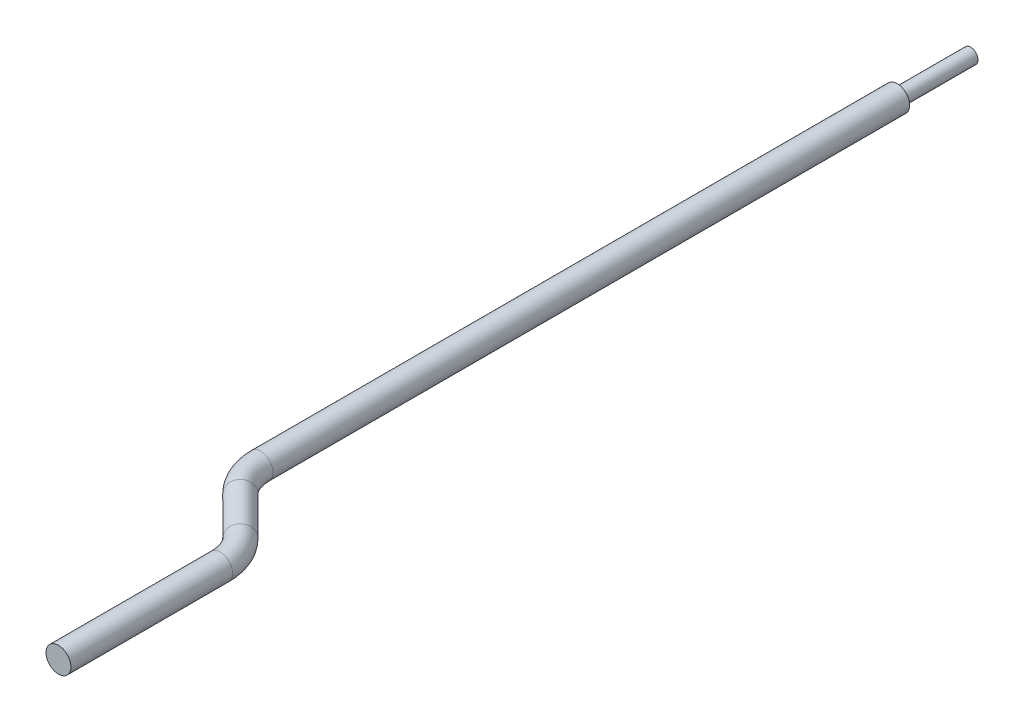
ISO-10303-21;
HEADER;
FILE_DESCRIPTION(('STEP AP214'),'2;1');
FILE_NAME('part.step','',(''),(''),'','','');
FILE_SCHEMA(('AUTOMOTIVE_DESIGN { 1 0 10303 214 1 1 1 1 }'));
ENDSEC;
DATA;
#1=APPLICATION_CONTEXT('core data for automotive mechanical design processes');
#2=APPLICATION_PROTOCOL_DEFINITION('international standard','automotive_design',2000,#1);
#3=PRODUCT_CONTEXT('',#1,'mechanical');
#4=PRODUCT('Part','Part','',(#3));
#5=PRODUCT_RELATED_PRODUCT_CATEGORY('part','',(#4));
#6=PRODUCT_DEFINITION_FORMATION('','',#4);
#7=PRODUCT_DEFINITION_CONTEXT('part definition',#1,'design');
#8=PRODUCT_DEFINITION('design','',#6,#7);
#9=PRODUCT_DEFINITION_SHAPE('','',#8);
#10=(LENGTH_UNIT() NAMED_UNIT(*) SI_UNIT(.MILLI.,.METRE.));
#11=(NAMED_UNIT(*) PLANE_ANGLE_UNIT() SI_UNIT($,.RADIAN.));
#12=(NAMED_UNIT(*) SI_UNIT($,.STERADIAN.) SOLID_ANGLE_UNIT());
#13=UNCERTAINTY_MEASURE_WITH_UNIT(LENGTH_MEASURE(1.E-05),#10,'distance_accuracy_value','');
#14=(GEOMETRIC_REPRESENTATION_CONTEXT(3) GLOBAL_UNCERTAINTY_ASSIGNED_CONTEXT((#13)) GLOBAL_UNIT_ASSIGNED_CONTEXT((#10,
#11,#12)) REPRESENTATION_CONTEXT('',''));
#15=CARTESIAN_POINT('',(0.,0.,0.));
#16=DIRECTION('',(0.,0.,1.));
#17=DIRECTION('',(1.,0.,0.));
#18=AXIS2_PLACEMENT_3D('',#15,#16,#17);
#19=CARTESIAN_POINT('',(0.,0.,35.56));
#20=DIRECTION('',(0.,0.,-1.));
#21=DIRECTION('',(-1.,0.,0.));
#22=AXIS2_PLACEMENT_3D('',#19,#20,#21);
#23=CYLINDRICAL_SURFACE('',#22,0.6477);
#24=CARTESIAN_POINT('',(0.,0.,36.83));
#25=DIRECTION('',(0.,0.,1.));
#26=DIRECTION('',(1.,0.,0.));
#27=AXIS2_PLACEMENT_3D('',#24,#25,#26);
#28=CIRCLE('',#27,0.6477);
#29=CARTESIAN_POINT('',(-0.647700000000004,0.,36.83));
#30=VERTEX_POINT('',#29);
#31=EDGE_CURVE('E49',#30,#30,#28,.T.);
#32=ORIENTED_EDGE('',*,*,#31,.F.);
#33=EDGE_LOOP('',(#32));
#34=FACE_BOUND('',#33,.T.);
#35=CARTESIAN_POINT('',(0.,0.,3.81));
#36=DIRECTION('',(0.,0.,-1.));
#37=DIRECTION('',(-1.,0.,0.));
#38=AXIS2_PLACEMENT_3D('',#35,#36,#37);
#39=CIRCLE('',#38,0.6477);
#40=CARTESIAN_POINT('',(-0.6477,0.,3.81));
#41=VERTEX_POINT('',#40);
#42=EDGE_CURVE('E52',#41,#41,#39,.T.);
#43=ORIENTED_EDGE('',*,*,#42,.F.);
#44=EDGE_LOOP('',(#43));
#45=FACE_BOUND('',#44,.T.);
#46=ADVANCED_FACE('F30',(#34,#45),#23,.T.);
#47=CARTESIAN_POINT('',(3.47980000000001,0.,42.4140048968553));
#48=DIRECTION('',(0.,0.,1.));
#49=DIRECTION('',(1.,0.,0.));
#50=AXIS2_PLACEMENT_3D('',#47,#48,#49);
#51=CYLINDRICAL_SURFACE('',#50,0.6477);
#52=CARTESIAN_POINT('',(3.47980000000001,0.,42.4140048968553));
#53=DIRECTION('',(0.,0.,1.));
#54=DIRECTION('',(1.,0.,0.));
#55=AXIS2_PLACEMENT_3D('',#52,#53,#54);
#56=CIRCLE('',#55,0.6477);
#57=CARTESIAN_POINT('',(4.1275,0.,42.4140048968553));
#58=VERTEX_POINT('',#57);
#59=EDGE_CURVE('E36',#58,#58,#56,.T.);
#60=ORIENTED_EDGE('',*,*,#59,.T.);
#61=EDGE_LOOP('',(#60));
#62=FACE_BOUND('',#61,.T.);
#63=CARTESIAN_POINT('',(3.4798,0.,50.8));
#64=DIRECTION('',(0.,0.,1.));
#65=DIRECTION('',(1.,0.,0.));
#66=AXIS2_PLACEMENT_3D('',#63,#64,#65);
#67=CIRCLE('',#66,0.6477);
#68=CARTESIAN_POINT('',(4.1275,0.,50.8));
#69=VERTEX_POINT('',#68);
#70=EDGE_CURVE('E10',#69,#69,#67,.T.);
#71=ORIENTED_EDGE('',*,*,#70,.F.);
#72=EDGE_LOOP('',(#71));
#73=FACE_BOUND('',#72,.T.);
#74=ADVANCED_FACE('F73',(#62,#73),#51,.T.);
#75=CARTESIAN_POINT('',(0.939800000000002,0.,42.4140048968553));
#76=DIRECTION('',(0.,-1.,0.));
#77=DIRECTION('',(0.,0.,-1.));
#78=AXIS2_PLACEMENT_3D('',#75,#76,#77);
#79=TOROIDAL_SURFACE('',#78,2.54,0.6477);
#80=CARTESIAN_POINT('',(2.73585122421383,0.,40.6179536726415));
#81=DIRECTION('',(0.707106781186549,0.,0.707106781186546));
#82=DIRECTION('',(0.707106781186546,0.,-0.707106781186549));
#83=AXIS2_PLACEMENT_3D('',#80,#81,#82);
#84=CIRCLE('',#83,0.6477);
#85=CARTESIAN_POINT('',(3.19384428638836,0.,40.159960610467));
#86=VERTEX_POINT('',#85);
#87=EDGE_CURVE('E40',#86,#86,#84,.T.);
#88=CARTESIAN_POINT('',(0.939800000000002,0.,42.4140048968553));
#89=DIRECTION('',(0.,-1.,0.));
#90=DIRECTION('',(0.,0.,-1.));
#91=AXIS2_PLACEMENT_3D('',#88,#89,#90);
#92=CIRCLE('',#91,3.1877);
#93=EDGE_CURVE('',#86,#58,#92,.T.);
#94=ORIENTED_EDGE('',*,*,#87,.T.);
#95=ORIENTED_EDGE('',*,*,#59,.F.);
#96=ORIENTED_EDGE('',*,*,#93,.T.);
#97=ORIENTED_EDGE('',*,*,#93,.F.);
#98=EDGE_LOOP('',(#94,#96,#95,#97));
#99=FACE_BOUND('',#98,.T.);
#100=ADVANCED_FACE('F78',(#99),#79,.T.);
#101=CARTESIAN_POINT('',(0.743948775786169,0.,38.6260512242138));
#102=DIRECTION('',(0.70710678118655,0.,0.707106781186545));
#103=DIRECTION('',(0.707106781186545,0.,-0.70710678118655));
#104=AXIS2_PLACEMENT_3D('',#101,#102,#103);
#105=CYLINDRICAL_SURFACE('',#104,0.6477);
#106=CARTESIAN_POINT('',(0.743948775786169,0.,38.6260512242138));
#107=DIRECTION('',(0.707106781186549,0.,0.707106781186546));
#108=DIRECTION('',(0.707106781186546,0.,-0.707106781186549));
#109=AXIS2_PLACEMENT_3D('',#106,#107,#108);
#110=CIRCLE('',#109,0.6477);
#111=CARTESIAN_POINT('',(0.285955713611646,0.,39.0840442863884));
#112=VERTEX_POINT('',#111);
#113=EDGE_CURVE('E44',#112,#112,#110,.T.);
#114=ORIENTED_EDGE('',*,*,#113,.T.);
#115=EDGE_LOOP('',(#114));
#116=FACE_BOUND('',#115,.T.);
#117=ORIENTED_EDGE('',*,*,#87,.F.);
#118=EDGE_LOOP('',(#117));
#119=FACE_BOUND('',#118,.T.);
#120=ADVANCED_FACE('F85',(#116,#119),#105,.T.);
#121=CARTESIAN_POINT('',(2.54,0.,36.83));
#122=DIRECTION('',(0.,1.,0.));
#123=DIRECTION('',(0.,0.,1.));
#124=AXIS2_PLACEMENT_3D('',#121,#122,#123);
#125=TOROIDAL_SURFACE('',#124,2.54,0.6477);
#126=CARTESIAN_POINT('',(2.54,0.,36.83));
#127=DIRECTION('',(0.,1.,0.));
#128=DIRECTION('',(0.,0.,1.));
#129=AXIS2_PLACEMENT_3D('',#126,#127,#128);
#130=CIRCLE('',#129,3.18770000000001);
#131=EDGE_CURVE('',#30,#112,#130,.T.);
#132=ORIENTED_EDGE('',*,*,#31,.T.);
#133=ORIENTED_EDGE('',*,*,#113,.F.);
#134=ORIENTED_EDGE('',*,*,#131,.T.);
#135=ORIENTED_EDGE('',*,*,#131,.F.);
#136=EDGE_LOOP('',(#132,#134,#133,#135));
#137=FACE_BOUND('',#136,.T.);
#138=ADVANCED_FACE('F82',(#137),#125,.T.);
#139=CARTESIAN_POINT('',(3.4798,0.,50.8));
#140=DIRECTION('',(0.,0.,1.));
#141=DIRECTION('',(1.,0.,0.));
#142=AXIS2_PLACEMENT_3D('',#139,#140,#141);
#143=PLANE('',#142);
#144=ORIENTED_EDGE('',*,*,#70,.T.);
#145=EDGE_LOOP('',(#144));
#146=FACE_BOUND('',#145,.T.);
#147=ADVANCED_FACE('F68',(#146),#143,.T.);
#148=CARTESIAN_POINT('',(0.,0.,3.81));
#149=DIRECTION('',(0.,0.,-1.));
#150=DIRECTION('',(-1.,0.,0.));
#151=AXIS2_PLACEMENT_3D('',#148,#149,#150);
#152=PLANE('',#151);
#153=CARTESIAN_POINT('',(0.,0.,3.81));
#154=DIRECTION('',(0.,0.,-1.));
#155=DIRECTION('',(-1.,0.,0.));
#156=AXIS2_PLACEMENT_3D('',#153,#154,#155);
#157=CIRCLE('',#156,0.381);
#158=CARTESIAN_POINT('',(-0.381,0.,3.81));
#159=VERTEX_POINT('',#158);
#160=EDGE_CURVE('E55',#159,#159,#157,.T.);
#161=ORIENTED_EDGE('',*,*,#160,.F.);
#162=EDGE_LOOP('',(#161));
#163=FACE_BOUND('',#162,.T.);
#164=ORIENTED_EDGE('',*,*,#42,.T.);
#165=EDGE_LOOP('',(#164));
#166=FACE_BOUND('',#165,.T.);
#167=ADVANCED_FACE('F65',(#163,#166),#152,.T.);
#168=CARTESIAN_POINT('',(0.,0.,3.81));
#169=DIRECTION('',(0.,0.,-1.));
#170=DIRECTION('',(-1.,0.,0.));
#171=AXIS2_PLACEMENT_3D('',#168,#169,#170);
#172=CYLINDRICAL_SURFACE('',#171,0.381);
#173=ORIENTED_EDGE('',*,*,#160,.T.);
#174=EDGE_LOOP('',(#173));
#175=FACE_BOUND('',#174,.T.);
#176=CARTESIAN_POINT('',(0.,0.,0.));
#177=DIRECTION('',(0.,0.,-1.));
#178=DIRECTION('',(-1.,0.,0.));
#179=AXIS2_PLACEMENT_3D('',#176,#177,#178);
#180=CIRCLE('',#179,0.381);
#181=CARTESIAN_POINT('',(-0.381,0.,0.));
#182=VERTEX_POINT('',#181);
#183=EDGE_CURVE('E56',#182,#182,#180,.T.);
#184=ORIENTED_EDGE('',*,*,#183,.F.);
#185=EDGE_LOOP('',(#184));
#186=FACE_BOUND('',#185,.T.);
#187=ADVANCED_FACE('F62',(#175,#186),#172,.T.);
#188=CARTESIAN_POINT('',(0.,0.,0.));
#189=DIRECTION('',(0.,0.,1.));
#190=DIRECTION('',(1.,0.,0.));
#191=AXIS2_PLACEMENT_3D('',#188,#189,#190);
#192=PLANE('',#191);
#193=ORIENTED_EDGE('',*,*,#183,.T.);
#194=EDGE_LOOP('',(#193));
#195=FACE_BOUND('',#194,.T.);
#196=ADVANCED_FACE('F99',(#195),#192,.F.);
#197=CLOSED_SHELL('',(#46,#74,#100,#120,#138,#147,#167,#187,#196));
#198=MANIFOLD_SOLID_BREP('B2',#197);
#199=ADVANCED_BREP_SHAPE_REPRESENTATION('',(#18,#198),#14);
#200=SHAPE_DEFINITION_REPRESENTATION(#9,#199);
ENDSEC;
END-ISO-10303-21;
